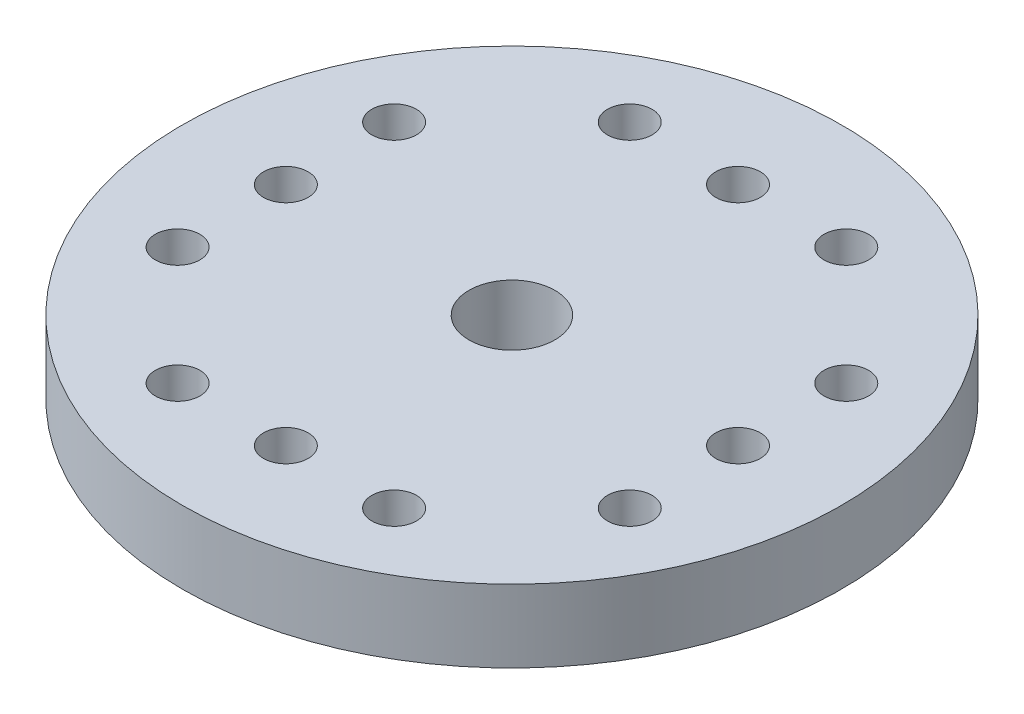
ISO-10303-21;
HEADER;
FILE_DESCRIPTION(('STEP AP214'),'2;1');
FILE_NAME('part.step','',(''),(''),'','','');
FILE_SCHEMA(('AUTOMOTIVE_DESIGN { 1 0 10303 214 1 1 1 1 }'));
ENDSEC;
DATA;
#1=APPLICATION_CONTEXT('core data for automotive mechanical design processes');
#2=APPLICATION_PROTOCOL_DEFINITION('international standard','automotive_design',2000,#1);
#3=PRODUCT_CONTEXT('',#1,'mechanical');
#4=PRODUCT('Part','Part','',(#3));
#5=PRODUCT_RELATED_PRODUCT_CATEGORY('part','',(#4));
#6=PRODUCT_DEFINITION_FORMATION('','',#4);
#7=PRODUCT_DEFINITION_CONTEXT('part definition',#1,'design');
#8=PRODUCT_DEFINITION('design','',#6,#7);
#9=PRODUCT_DEFINITION_SHAPE('','',#8);
#10=(LENGTH_UNIT() NAMED_UNIT(*) SI_UNIT(.MILLI.,.METRE.));
#11=(NAMED_UNIT(*) PLANE_ANGLE_UNIT() SI_UNIT($,.RADIAN.));
#12=(NAMED_UNIT(*) SI_UNIT($,.STERADIAN.) SOLID_ANGLE_UNIT());
#13=UNCERTAINTY_MEASURE_WITH_UNIT(LENGTH_MEASURE(1.E-05),#10,'distance_accuracy_value','');
#14=(GEOMETRIC_REPRESENTATION_CONTEXT(3) GLOBAL_UNCERTAINTY_ASSIGNED_CONTEXT((#13)) GLOBAL_UNIT_ASSIGNED_CONTEXT((#10,
#11,#12)) REPRESENTATION_CONTEXT('',''));
#15=CARTESIAN_POINT('',(0.,0.,0.));
#16=DIRECTION('',(0.,0.,1.));
#17=DIRECTION('',(1.,0.,0.));
#18=AXIS2_PLACEMENT_3D('',#15,#16,#17);
#19=CARTESIAN_POINT('',(0.,-2.28,0.));
#20=DIRECTION('',(0.,1.,0.));
#21=DIRECTION('',(0.,0.,1.));
#22=AXIS2_PLACEMENT_3D('',#19,#20,#21);
#23=CYLINDRICAL_SURFACE('',#22,10.35);
#24=CARTESIAN_POINT('',(0.,-2.28,0.));
#25=DIRECTION('',(0.,1.,0.));
#26=DIRECTION('',(0.,0.,1.));
#27=AXIS2_PLACEMENT_3D('',#24,#25,#26);
#28=CIRCLE('',#27,10.35);
#29=CARTESIAN_POINT('',(0.,-2.28,10.35));
#30=VERTEX_POINT('',#29);
#31=EDGE_CURVE('E38',#30,#30,#28,.T.);
#32=ORIENTED_EDGE('',*,*,#31,.T.);
#33=EDGE_LOOP('',(#32));
#34=FACE_BOUND('',#33,.T.);
#35=CARTESIAN_POINT('',(0.,0.,0.));
#36=DIRECTION('',(0.,1.,0.));
#37=DIRECTION('',(0.,0.,1.));
#38=AXIS2_PLACEMENT_3D('',#35,#36,#37);
#39=CIRCLE('',#38,10.35);
#40=CARTESIAN_POINT('',(0.,0.,10.35));
#41=VERTEX_POINT('',#40);
#42=EDGE_CURVE('E43',#41,#41,#39,.T.);
#43=ORIENTED_EDGE('',*,*,#42,.F.);
#44=EDGE_LOOP('',(#43));
#45=FACE_BOUND('',#44,.T.);
#46=ADVANCED_FACE('F31',(#34,#45),#23,.T.);
#47=CARTESIAN_POINT('',(0.,-2.28,0.));
#48=DIRECTION('',(0.,1.,0.));
#49=DIRECTION('',(0.,0.,1.));
#50=AXIS2_PLACEMENT_3D('',#47,#48,#49);
#51=PLANE('',#50);
#52=CARTESIAN_POINT('',(0.,-2.28,-7.1));
#53=DIRECTION('',(0.,1.,0.));
#54=DIRECTION('',(0.,0.,1.));
#55=AXIS2_PLACEMENT_3D('',#52,#53,#54);
#56=CIRCLE('',#55,0.7);
#57=CARTESIAN_POINT('',(0.,-2.28,-6.4));
#58=VERTEX_POINT('',#57);
#59=EDGE_CURVE('E80',#58,#58,#56,.T.);
#60=ORIENTED_EDGE('',*,*,#59,.T.);
#61=EDGE_LOOP('',(#60));
#62=FACE_BOUND('',#61,.T.);
#63=CARTESIAN_POINT('',(3.39999999999997,-2.28,-7.10000000000001));
#64=DIRECTION('',(0.,1.,0.));
#65=DIRECTION('',(0.,0.,1.));
#66=AXIS2_PLACEMENT_3D('',#63,#64,#65);
#67=CIRCLE('',#66,0.700000000000001);
#68=CARTESIAN_POINT('',(3.39999999999997,-2.28,-6.40000000000001));
#69=VERTEX_POINT('',#68);
#70=EDGE_CURVE('E87',#69,#69,#67,.T.);
#71=ORIENTED_EDGE('',*,*,#70,.T.);
#72=EDGE_LOOP('',(#71));
#73=FACE_BOUND('',#72,.T.);
#74=CARTESIAN_POINT('',(-7.1,-2.28,3.4));
#75=DIRECTION('',(0.,1.,0.));
#76=DIRECTION('',(0.,0.,1.));
#77=AXIS2_PLACEMENT_3D('',#74,#75,#76);
#78=CIRCLE('',#77,0.7);
#79=CARTESIAN_POINT('',(-7.1,-2.28,4.1));
#80=VERTEX_POINT('',#79);
#81=EDGE_CURVE('E90',#80,#80,#78,.T.);
#82=ORIENTED_EDGE('',*,*,#81,.T.);
#83=EDGE_LOOP('',(#82));
#84=FACE_BOUND('',#83,.T.);
#85=CARTESIAN_POINT('',(-7.1,-2.28,0.));
#86=DIRECTION('',(0.,1.,0.));
#87=DIRECTION('',(0.,0.,1.));
#88=AXIS2_PLACEMENT_3D('',#85,#86,#87);
#89=CIRCLE('',#88,0.7);
#90=CARTESIAN_POINT('',(-7.1,-2.28,0.7));
#91=VERTEX_POINT('',#90);
#92=EDGE_CURVE('E93',#91,#91,#89,.T.);
#93=ORIENTED_EDGE('',*,*,#92,.T.);
#94=EDGE_LOOP('',(#93));
#95=FACE_BOUND('',#94,.T.);
#96=CARTESIAN_POINT('',(-3.39999999999993,-2.28,7.10000000000004));
#97=DIRECTION('',(0.,1.,0.));
#98=DIRECTION('',(0.,0.,1.));
#99=AXIS2_PLACEMENT_3D('',#96,#97,#98);
#100=CIRCLE('',#99,0.700000000000001);
#101=CARTESIAN_POINT('',(-3.39999999999993,-2.28,7.80000000000004));
#102=VERTEX_POINT('',#101);
#103=EDGE_CURVE('E96',#102,#102,#100,.T.);
#104=ORIENTED_EDGE('',*,*,#103,.T.);
#105=EDGE_LOOP('',(#104));
#106=FACE_BOUND('',#105,.T.);
#107=CARTESIAN_POINT('',(0.,-2.28,7.1));
#108=DIRECTION('',(0.,1.,0.));
#109=DIRECTION('',(0.,0.,1.));
#110=AXIS2_PLACEMENT_3D('',#107,#108,#109);
#111=CIRCLE('',#110,0.7);
#112=CARTESIAN_POINT('',(0.,-2.28,7.8));
#113=VERTEX_POINT('',#112);
#114=EDGE_CURVE('E99',#113,#113,#111,.T.);
#115=ORIENTED_EDGE('',*,*,#114,.T.);
#116=EDGE_LOOP('',(#115));
#117=FACE_BOUND('',#116,.T.);
#118=CARTESIAN_POINT('',(3.40000000000007,-2.28,7.09999999999997));
#119=DIRECTION('',(0.,1.,0.));
#120=DIRECTION('',(0.,0.,1.));
#121=AXIS2_PLACEMENT_3D('',#118,#119,#120);
#122=CIRCLE('',#121,0.7);
#123=CARTESIAN_POINT('',(3.40000000000007,-2.28,7.79999999999997));
#124=VERTEX_POINT('',#123);
#125=EDGE_CURVE('E102',#124,#124,#122,.T.);
#126=ORIENTED_EDGE('',*,*,#125,.T.);
#127=EDGE_LOOP('',(#126));
#128=FACE_BOUND('',#127,.T.);
#129=CARTESIAN_POINT('',(-7.1,-2.28,-3.4));
#130=DIRECTION('',(0.,1.,0.));
#131=DIRECTION('',(0.,0.,1.));
#132=AXIS2_PLACEMENT_3D('',#129,#130,#131);
#133=CIRCLE('',#132,0.700000000000001);
#134=CARTESIAN_POINT('',(-7.1,-2.28,-2.7));
#135=VERTEX_POINT('',#134);
#136=EDGE_CURVE('E105',#135,#135,#133,.T.);
#137=ORIENTED_EDGE('',*,*,#136,.T.);
#138=EDGE_LOOP('',(#137));
#139=FACE_BOUND('',#138,.T.);
#140=CARTESIAN_POINT('',(-3.40000000000002,-2.28,-7.09999999999999));
#141=DIRECTION('',(0.,1.,0.));
#142=DIRECTION('',(0.,0.,1.));
#143=AXIS2_PLACEMENT_3D('',#140,#141,#142);
#144=CIRCLE('',#143,0.7);
#145=CARTESIAN_POINT('',(-3.40000000000002,-2.28,-6.39999999999999));
#146=VERTEX_POINT('',#145);
#147=EDGE_CURVE('E108',#146,#146,#144,.T.);
#148=ORIENTED_EDGE('',*,*,#147,.T.);
#149=EDGE_LOOP('',(#148));
#150=FACE_BOUND('',#149,.T.);
#151=CARTESIAN_POINT('',(7.1,-2.28,-3.4));
#152=DIRECTION('',(0.,1.,0.));
#153=DIRECTION('',(0.,0.,1.));
#154=AXIS2_PLACEMENT_3D('',#151,#152,#153);
#155=CIRCLE('',#154,0.7);
#156=CARTESIAN_POINT('',(7.1,-2.28,-2.7));
#157=VERTEX_POINT('',#156);
#158=EDGE_CURVE('E66',#157,#157,#155,.T.);
#159=ORIENTED_EDGE('',*,*,#158,.T.);
#160=EDGE_LOOP('',(#159));
#161=FACE_BOUND('',#160,.T.);
#162=CARTESIAN_POINT('',(7.1,-2.28,0.));
#163=DIRECTION('',(0.,1.,0.));
#164=DIRECTION('',(0.,0.,1.));
#165=AXIS2_PLACEMENT_3D('',#162,#163,#164);
#166=CIRCLE('',#165,0.7);
#167=CARTESIAN_POINT('',(7.1,-2.28,0.7));
#168=VERTEX_POINT('',#167);
#169=EDGE_CURVE('E69',#168,#168,#166,.T.);
#170=ORIENTED_EDGE('',*,*,#169,.T.);
#171=EDGE_LOOP('',(#170));
#172=FACE_BOUND('',#171,.T.);
#173=CARTESIAN_POINT('',(7.1,-2.28,3.4));
#174=DIRECTION('',(0.,1.,0.));
#175=DIRECTION('',(0.,0.,1.));
#176=AXIS2_PLACEMENT_3D('',#173,#174,#175);
#177=CIRCLE('',#176,0.700000000000001);
#178=CARTESIAN_POINT('',(7.1,-2.28,4.1));
#179=VERTEX_POINT('',#178);
#180=EDGE_CURVE('E72',#179,#179,#177,.T.);
#181=ORIENTED_EDGE('',*,*,#180,.T.);
#182=EDGE_LOOP('',(#181));
#183=FACE_BOUND('',#182,.T.);
#184=CARTESIAN_POINT('',(0.,-2.28,0.));
#185=DIRECTION('',(0.,-1.,0.));
#186=DIRECTION('',(0.,0.,-1.));
#187=AXIS2_PLACEMENT_3D('',#184,#185,#186);
#188=CIRCLE('',#187,4.35);
#189=CARTESIAN_POINT('',(0.,-2.28,-4.35));
#190=VERTEX_POINT('',#189);
#191=EDGE_CURVE('E10',#190,#190,#188,.T.);
#192=ORIENTED_EDGE('',*,*,#191,.F.);
#193=EDGE_LOOP('',(#192));
#194=FACE_BOUND('',#193,.T.);
#195=ORIENTED_EDGE('',*,*,#31,.F.);
#196=EDGE_LOOP('',(#195));
#197=FACE_BOUND('',#196,.T.);
#198=ADVANCED_FACE('F146',(#62,#73,#84,#95,#106,#117,#128,#139,#150,#161,#172,#183,#194,#197),
#51,.F.);
#199=CARTESIAN_POINT('',(0.,0.,0.));
#200=DIRECTION('',(0.,1.,0.));
#201=DIRECTION('',(0.,0.,1.));
#202=AXIS2_PLACEMENT_3D('',#199,#200,#201);
#203=PLANE('',#202);
#204=CARTESIAN_POINT('',(0.,0.,-7.1));
#205=DIRECTION('',(0.,1.,0.));
#206=DIRECTION('',(1.,0.,0.));
#207=AXIS2_PLACEMENT_3D('',#204,#205,#206);
#208=CIRCLE('',#207,0.7);
#209=CARTESIAN_POINT('',(0.699999999999975,0.,-7.1));
#210=VERTEX_POINT('',#209);
#211=EDGE_CURVE('E114',#210,#210,#208,.T.);
#212=ORIENTED_EDGE('',*,*,#211,.F.);
#213=EDGE_LOOP('',(#212));
#214=FACE_BOUND('',#213,.T.);
#215=CARTESIAN_POINT('',(3.39999999999997,0.,-7.10000000000001));
#216=DIRECTION('',(0.,1.,0.));
#217=DIRECTION('',(1.,0.,0.));
#218=AXIS2_PLACEMENT_3D('',#215,#216,#217);
#219=CIRCLE('',#218,0.700000000000001);
#220=CARTESIAN_POINT('',(4.09999999999997,0.,-7.10000000000002));
#221=VERTEX_POINT('',#220);
#222=EDGE_CURVE('E122',#221,#221,#219,.T.);
#223=ORIENTED_EDGE('',*,*,#222,.F.);
#224=EDGE_LOOP('',(#223));
#225=FACE_BOUND('',#224,.T.);
#226=CARTESIAN_POINT('',(-7.1,0.,3.4));
#227=DIRECTION('',(0.,1.,0.));
#228=DIRECTION('',(0.,0.,-1.));
#229=AXIS2_PLACEMENT_3D('',#226,#227,#228);
#230=CIRCLE('',#229,0.7);
#231=CARTESIAN_POINT('',(-7.1,0.,2.7));
#232=VERTEX_POINT('',#231);
#233=EDGE_CURVE('E118',#232,#232,#230,.T.);
#234=ORIENTED_EDGE('',*,*,#233,.F.);
#235=EDGE_LOOP('',(#234));
#236=FACE_BOUND('',#235,.T.);
#237=CARTESIAN_POINT('',(-7.1,0.,0.));
#238=DIRECTION('',(0.,1.,0.));
#239=DIRECTION('',(0.,0.,-1.));
#240=AXIS2_PLACEMENT_3D('',#237,#238,#239);
#241=CIRCLE('',#240,0.7);
#242=CARTESIAN_POINT('',(-7.1,0.,-0.7));
#243=VERTEX_POINT('',#242);
#244=EDGE_CURVE('E115',#243,#243,#241,.T.);
#245=ORIENTED_EDGE('',*,*,#244,.F.);
#246=EDGE_LOOP('',(#245));
#247=FACE_BOUND('',#246,.T.);
#248=CARTESIAN_POINT('',(-3.39999999999993,0.,7.10000000000004));
#249=DIRECTION('',(0.,1.,0.));
#250=DIRECTION('',(-1.,0.,0.));
#251=AXIS2_PLACEMENT_3D('',#248,#249,#250);
#252=CIRCLE('',#251,0.700000000000001);
#253=CARTESIAN_POINT('',(-4.09999999999993,0.,7.10000000000004));
#254=VERTEX_POINT('',#253);
#255=EDGE_CURVE('E133',#254,#254,#252,.T.);
#256=ORIENTED_EDGE('',*,*,#255,.F.);
#257=EDGE_LOOP('',(#256));
#258=FACE_BOUND('',#257,.T.);
#259=CARTESIAN_POINT('',(0.,0.,7.1));
#260=DIRECTION('',(0.,1.,0.));
#261=DIRECTION('',(-1.,0.,0.));
#262=AXIS2_PLACEMENT_3D('',#259,#260,#261);
#263=CIRCLE('',#262,0.7);
#264=CARTESIAN_POINT('',(-0.699999999999925,0.,7.10000000000001));
#265=VERTEX_POINT('',#264);
#266=EDGE_CURVE('E130',#265,#265,#263,.T.);
#267=ORIENTED_EDGE('',*,*,#266,.F.);
#268=EDGE_LOOP('',(#267));
#269=FACE_BOUND('',#268,.T.);
#270=CARTESIAN_POINT('',(3.40000000000007,0.,7.09999999999997));
#271=DIRECTION('',(0.,1.,0.));
#272=DIRECTION('',(-1.,0.,0.));
#273=AXIS2_PLACEMENT_3D('',#270,#271,#272);
#274=CIRCLE('',#273,0.7);
#275=CARTESIAN_POINT('',(2.70000000000007,0.,7.09999999999997));
#276=VERTEX_POINT('',#275);
#277=EDGE_CURVE('E127',#276,#276,#274,.T.);
#278=ORIENTED_EDGE('',*,*,#277,.F.);
#279=EDGE_LOOP('',(#278));
#280=FACE_BOUND('',#279,.T.);
#281=CARTESIAN_POINT('',(-7.1,0.,-3.4));
#282=DIRECTION('',(0.,1.,0.));
#283=DIRECTION('',(0.,0.,-1.));
#284=AXIS2_PLACEMENT_3D('',#281,#282,#283);
#285=CIRCLE('',#284,0.700000000000001);
#286=CARTESIAN_POINT('',(-7.1,0.,-4.1));
#287=VERTEX_POINT('',#286);
#288=EDGE_CURVE('E119',#287,#287,#285,.T.);
#289=ORIENTED_EDGE('',*,*,#288,.F.);
#290=EDGE_LOOP('',(#289));
#291=FACE_BOUND('',#290,.T.);
#292=CARTESIAN_POINT('',(-3.40000000000002,0.,-7.09999999999999));
#293=DIRECTION('',(0.,1.,0.));
#294=DIRECTION('',(1.,0.,0.));
#295=AXIS2_PLACEMENT_3D('',#292,#293,#294);
#296=CIRCLE('',#295,0.7);
#297=CARTESIAN_POINT('',(-2.70000000000002,0.,-7.09999999999999));
#298=VERTEX_POINT('',#297);
#299=EDGE_CURVE('E111',#298,#298,#296,.T.);
#300=ORIENTED_EDGE('',*,*,#299,.F.);
#301=EDGE_LOOP('',(#300));
#302=FACE_BOUND('',#301,.T.);
#303=CARTESIAN_POINT('',(7.1,0.,-3.4));
#304=DIRECTION('',(0.,1.,0.));
#305=DIRECTION('',(0.,0.,1.));
#306=AXIS2_PLACEMENT_3D('',#303,#304,#305);
#307=CIRCLE('',#306,0.7);
#308=CARTESIAN_POINT('',(7.1,0.,-2.7));
#309=VERTEX_POINT('',#308);
#310=EDGE_CURVE('E75',#309,#309,#307,.T.);
#311=ORIENTED_EDGE('',*,*,#310,.F.);
#312=EDGE_LOOP('',(#311));
#313=FACE_BOUND('',#312,.T.);
#314=CARTESIAN_POINT('',(7.1,0.,0.));
#315=DIRECTION('',(0.,1.,0.));
#316=DIRECTION('',(0.,0.,1.));
#317=AXIS2_PLACEMENT_3D('',#314,#315,#316);
#318=CIRCLE('',#317,0.7);
#319=CARTESIAN_POINT('',(7.1,0.,0.7));
#320=VERTEX_POINT('',#319);
#321=EDGE_CURVE('E79',#320,#320,#318,.T.);
#322=ORIENTED_EDGE('',*,*,#321,.F.);
#323=EDGE_LOOP('',(#322));
#324=FACE_BOUND('',#323,.T.);
#325=CARTESIAN_POINT('',(7.1,0.,3.4));
#326=DIRECTION('',(0.,1.,0.));
#327=DIRECTION('',(0.,0.,1.));
#328=AXIS2_PLACEMENT_3D('',#325,#326,#327);
#329=CIRCLE('',#328,0.700000000000001);
#330=CARTESIAN_POINT('',(7.1,0.,4.1));
#331=VERTEX_POINT('',#330);
#332=EDGE_CURVE('E76',#331,#331,#329,.T.);
#333=ORIENTED_EDGE('',*,*,#332,.F.);
#334=EDGE_LOOP('',(#333));
#335=FACE_BOUND('',#334,.T.);
#336=CARTESIAN_POINT('',(0.,0.,0.));
#337=DIRECTION('',(0.,1.,0.));
#338=DIRECTION('',(0.,0.,1.));
#339=AXIS2_PLACEMENT_3D('',#336,#337,#338);
#340=CIRCLE('',#339,1.35);
#341=CARTESIAN_POINT('',(0.,0.,1.35));
#342=VERTEX_POINT('',#341);
#343=EDGE_CURVE('E52',#342,#342,#340,.T.);
#344=ORIENTED_EDGE('',*,*,#343,.F.);
#345=EDGE_LOOP('',(#344));
#346=FACE_BOUND('',#345,.T.);
#347=ORIENTED_EDGE('',*,*,#42,.T.);
#348=EDGE_LOOP('',(#347));
#349=FACE_BOUND('',#348,.T.);
#350=ADVANCED_FACE('F142',(#214,#225,#236,#247,#258,#269,#280,#291,#302,#313,#324,#335,#346,
#349),#203,.T.);
#351=CARTESIAN_POINT('',(0.,-5.38,0.));
#352=DIRECTION('',(0.,1.,0.));
#353=DIRECTION('',(0.,0.,1.));
#354=AXIS2_PLACEMENT_3D('',#351,#352,#353);
#355=CYLINDRICAL_SURFACE('',#354,4.35);
#356=CARTESIAN_POINT('',(0.,-5.38,0.));
#357=DIRECTION('',(0.,-1.,0.));
#358=DIRECTION('',(0.,0.,-1.));
#359=AXIS2_PLACEMENT_3D('',#356,#357,#358);
#360=CIRCLE('',#359,4.35);
#361=CARTESIAN_POINT('',(0.,-5.38,-4.35));
#362=VERTEX_POINT('',#361);
#363=EDGE_CURVE('E46',#362,#362,#360,.T.);
#364=ORIENTED_EDGE('',*,*,#363,.F.);
#365=EDGE_LOOP('',(#364));
#366=FACE_BOUND('',#365,.T.);
#367=ORIENTED_EDGE('',*,*,#191,.T.);
#368=EDGE_LOOP('',(#367));
#369=FACE_BOUND('',#368,.T.);
#370=ADVANCED_FACE('F145',(#366,#369),#355,.T.);
#371=CARTESIAN_POINT('',(0.,-5.38,0.));
#372=DIRECTION('',(0.,-1.,0.));
#373=DIRECTION('',(0.,0.,-1.));
#374=AXIS2_PLACEMENT_3D('',#371,#372,#373);
#375=PLANE('',#374);
#376=CARTESIAN_POINT('',(0.,-5.38,0.));
#377=DIRECTION('',(0.,-1.,0.));
#378=DIRECTION('',(0.,0.,-1.));
#379=AXIS2_PLACEMENT_3D('',#376,#377,#378);
#380=CIRCLE('',#379,2.65);
#381=CARTESIAN_POINT('',(0.,-5.38,-2.65));
#382=VERTEX_POINT('',#381);
#383=EDGE_CURVE('E63',#382,#382,#380,.T.);
#384=ORIENTED_EDGE('',*,*,#383,.F.);
#385=EDGE_LOOP('',(#384));
#386=FACE_BOUND('',#385,.T.);
#387=ORIENTED_EDGE('',*,*,#363,.T.);
#388=EDGE_LOOP('',(#387));
#389=FACE_BOUND('',#388,.T.);
#390=ADVANCED_FACE('F196',(#386,#389),#375,.T.);
#391=CARTESIAN_POINT('',(0.,-5.38,0.));
#392=DIRECTION('',(0.,1.,0.));
#393=DIRECTION('',(0.,0.,1.));
#394=AXIS2_PLACEMENT_3D('',#391,#392,#393);
#395=CYLINDRICAL_SURFACE('',#394,1.35);
#396=CARTESIAN_POINT('',(0.,-2.28,0.));
#397=DIRECTION('',(0.,1.,0.));
#398=DIRECTION('',(0.,0.,1.));
#399=AXIS2_PLACEMENT_3D('',#396,#397,#398);
#400=CIRCLE('',#399,1.35);
#401=CARTESIAN_POINT('',(0.,-2.28,1.35));
#402=VERTEX_POINT('',#401);
#403=EDGE_CURVE('E34',#402,#402,#400,.F.);
#404=ORIENTED_EDGE('',*,*,#403,.T.);
#405=EDGE_LOOP('',(#404));
#406=FACE_BOUND('',#405,.T.);
#407=ORIENTED_EDGE('',*,*,#343,.T.);
#408=EDGE_LOOP('',(#407));
#409=FACE_BOUND('',#408,.T.);
#410=ADVANCED_FACE('F204',(#406,#409),#395,.F.);
#411=CARTESIAN_POINT('',(0.,-2.28,0.));
#412=DIRECTION('',(0.,1.,0.));
#413=DIRECTION('',(0.,0.,1.));
#414=AXIS2_PLACEMENT_3D('',#411,#412,#413);
#415=PLANE('',#414);
#416=CARTESIAN_POINT('',(0.,-2.28,0.));
#417=DIRECTION('',(0.,1.,0.));
#418=DIRECTION('',(0.,0.,1.));
#419=AXIS2_PLACEMENT_3D('',#416,#417,#418);
#420=CIRCLE('',#419,2.65);
#421=CARTESIAN_POINT('',(0.,-2.28,2.65));
#422=VERTEX_POINT('',#421);
#423=EDGE_CURVE('E59',#422,#422,#420,.F.);
#424=ORIENTED_EDGE('',*,*,#423,.T.);
#425=EDGE_LOOP('',(#424));
#426=FACE_BOUND('',#425,.T.);
#427=ORIENTED_EDGE('',*,*,#403,.F.);
#428=EDGE_LOOP('',(#427));
#429=FACE_BOUND('',#428,.T.);
#430=ADVANCED_FACE('F212',(#426,#429),#415,.F.);
#431=CARTESIAN_POINT('',(0.,5.2153318805774,0.));
#432=DIRECTION('',(0.,-1.,0.));
#433=DIRECTION('',(0.,0.,-1.));
#434=AXIS2_PLACEMENT_3D('',#431,#432,#433);
#435=CYLINDRICAL_SURFACE('',#434,2.65);
#436=ORIENTED_EDGE('',*,*,#383,.T.);
#437=EDGE_LOOP('',(#436));
#438=FACE_BOUND('',#437,.T.);
#439=ORIENTED_EDGE('',*,*,#423,.F.);
#440=EDGE_LOOP('',(#439));
#441=FACE_BOUND('',#440,.T.);
#442=ADVANCED_FACE('F165',(#438,#441),#435,.F.);
#443=CARTESIAN_POINT('',(7.1,-3.1,3.4));
#444=DIRECTION('',(0.,1.,0.));
#445=DIRECTION('',(0.,0.,1.));
#446=AXIS2_PLACEMENT_3D('',#443,#444,#445);
#447=CYLINDRICAL_SURFACE('',#446,0.700000000000001);
#448=ORIENTED_EDGE('',*,*,#332,.T.);
#449=EDGE_LOOP('',(#448));
#450=FACE_BOUND('',#449,.T.);
#451=ORIENTED_EDGE('',*,*,#180,.F.);
#452=EDGE_LOOP('',(#451));
#453=FACE_BOUND('',#452,.T.);
#454=ADVANCED_FACE('F161',(#450,#453),#447,.F.);
#455=CARTESIAN_POINT('',(7.1,-3.1,0.));
#456=DIRECTION('',(0.,1.,0.));
#457=DIRECTION('',(0.,0.,1.));
#458=AXIS2_PLACEMENT_3D('',#455,#456,#457);
#459=CYLINDRICAL_SURFACE('',#458,0.7);
#460=ORIENTED_EDGE('',*,*,#321,.T.);
#461=EDGE_LOOP('',(#460));
#462=FACE_BOUND('',#461,.T.);
#463=ORIENTED_EDGE('',*,*,#169,.F.);
#464=EDGE_LOOP('',(#463));
#465=FACE_BOUND('',#464,.T.);
#466=ADVANCED_FACE('F164',(#462,#465),#459,.F.);
#467=CARTESIAN_POINT('',(7.1,-3.1,-3.4));
#468=DIRECTION('',(0.,1.,0.));
#469=DIRECTION('',(0.,0.,1.));
#470=AXIS2_PLACEMENT_3D('',#467,#468,#469);
#471=CYLINDRICAL_SURFACE('',#470,0.7);
#472=ORIENTED_EDGE('',*,*,#310,.T.);
#473=EDGE_LOOP('',(#472));
#474=FACE_BOUND('',#473,.T.);
#475=ORIENTED_EDGE('',*,*,#158,.F.);
#476=EDGE_LOOP('',(#475));
#477=FACE_BOUND('',#476,.T.);
#478=ADVANCED_FACE('F238',(#474,#477),#471,.F.);
#479=CARTESIAN_POINT('',(-3.40000000000002,-3.1,-7.09999999999999));
#480=DIRECTION('',(0.,1.,0.));
#481=DIRECTION('',(0.,0.,1.));
#482=AXIS2_PLACEMENT_3D('',#479,#480,#481);
#483=CYLINDRICAL_SURFACE('',#482,0.7);
#484=ORIENTED_EDGE('',*,*,#299,.T.);
#485=EDGE_LOOP('',(#484));
#486=FACE_BOUND('',#485,.T.);
#487=ORIENTED_EDGE('',*,*,#147,.F.);
#488=EDGE_LOOP('',(#487));
#489=FACE_BOUND('',#488,.T.);
#490=ADVANCED_FACE('F245',(#486,#489),#483,.F.);
#491=CARTESIAN_POINT('',(-7.1,-3.1,-3.4));
#492=DIRECTION('',(0.,1.,0.));
#493=DIRECTION('',(0.,0.,1.));
#494=AXIS2_PLACEMENT_3D('',#491,#492,#493);
#495=CYLINDRICAL_SURFACE('',#494,0.700000000000001);
#496=ORIENTED_EDGE('',*,*,#288,.T.);
#497=EDGE_LOOP('',(#496));
#498=FACE_BOUND('',#497,.T.);
#499=ORIENTED_EDGE('',*,*,#136,.F.);
#500=EDGE_LOOP('',(#499));
#501=FACE_BOUND('',#500,.T.);
#502=ADVANCED_FACE('F252',(#498,#501),#495,.F.);
#503=CARTESIAN_POINT('',(3.40000000000007,-3.1,7.09999999999997));
#504=DIRECTION('',(0.,1.,0.));
#505=DIRECTION('',(0.,0.,1.));
#506=AXIS2_PLACEMENT_3D('',#503,#504,#505);
#507=CYLINDRICAL_SURFACE('',#506,0.7);
#508=ORIENTED_EDGE('',*,*,#277,.T.);
#509=EDGE_LOOP('',(#508));
#510=FACE_BOUND('',#509,.T.);
#511=ORIENTED_EDGE('',*,*,#125,.F.);
#512=EDGE_LOOP('',(#511));
#513=FACE_BOUND('',#512,.T.);
#514=ADVANCED_FACE('F260',(#510,#513),#507,.F.);
#515=CARTESIAN_POINT('',(0.,-3.1,7.1));
#516=DIRECTION('',(0.,1.,0.));
#517=DIRECTION('',(0.,0.,1.));
#518=AXIS2_PLACEMENT_3D('',#515,#516,#517);
#519=CYLINDRICAL_SURFACE('',#518,0.7);
#520=ORIENTED_EDGE('',*,*,#266,.T.);
#521=EDGE_LOOP('',(#520));
#522=FACE_BOUND('',#521,.T.);
#523=ORIENTED_EDGE('',*,*,#114,.F.);
#524=EDGE_LOOP('',(#523));
#525=FACE_BOUND('',#524,.T.);
#526=ADVANCED_FACE('F139',(#522,#525),#519,.F.);
#527=CARTESIAN_POINT('',(-3.39999999999993,-3.1,7.10000000000004));
#528=DIRECTION('',(0.,1.,0.));
#529=DIRECTION('',(0.,0.,1.));
#530=AXIS2_PLACEMENT_3D('',#527,#528,#529);
#531=CYLINDRICAL_SURFACE('',#530,0.700000000000001);
#532=ORIENTED_EDGE('',*,*,#255,.T.);
#533=EDGE_LOOP('',(#532));
#534=FACE_BOUND('',#533,.T.);
#535=ORIENTED_EDGE('',*,*,#103,.F.);
#536=EDGE_LOOP('',(#535));
#537=FACE_BOUND('',#536,.T.);
#538=ADVANCED_FACE('F275',(#534,#537),#531,.F.);
#539=CARTESIAN_POINT('',(-7.1,-3.1,0.));
#540=DIRECTION('',(0.,1.,0.));
#541=DIRECTION('',(0.,0.,1.));
#542=AXIS2_PLACEMENT_3D('',#539,#540,#541);
#543=CYLINDRICAL_SURFACE('',#542,0.7);
#544=ORIENTED_EDGE('',*,*,#244,.T.);
#545=EDGE_LOOP('',(#544));
#546=FACE_BOUND('',#545,.T.);
#547=ORIENTED_EDGE('',*,*,#92,.F.);
#548=EDGE_LOOP('',(#547));
#549=FACE_BOUND('',#548,.T.);
#550=ADVANCED_FACE('F282',(#546,#549),#543,.F.);
#551=CARTESIAN_POINT('',(-7.1,-3.1,3.4));
#552=DIRECTION('',(0.,1.,0.));
#553=DIRECTION('',(0.,0.,1.));
#554=AXIS2_PLACEMENT_3D('',#551,#552,#553);
#555=CYLINDRICAL_SURFACE('',#554,0.7);
#556=ORIENTED_EDGE('',*,*,#233,.T.);
#557=EDGE_LOOP('',(#556));
#558=FACE_BOUND('',#557,.T.);
#559=ORIENTED_EDGE('',*,*,#81,.F.);
#560=EDGE_LOOP('',(#559));
#561=FACE_BOUND('',#560,.T.);
#562=ADVANCED_FACE('F290',(#558,#561),#555,.F.);
#563=CARTESIAN_POINT('',(3.39999999999997,-3.1,-7.10000000000001));
#564=DIRECTION('',(0.,1.,0.));
#565=DIRECTION('',(0.,0.,1.));
#566=AXIS2_PLACEMENT_3D('',#563,#564,#565);
#567=CYLINDRICAL_SURFACE('',#566,0.700000000000001);
#568=ORIENTED_EDGE('',*,*,#222,.T.);
#569=EDGE_LOOP('',(#568));
#570=FACE_BOUND('',#569,.T.);
#571=ORIENTED_EDGE('',*,*,#70,.F.);
#572=EDGE_LOOP('',(#571));
#573=FACE_BOUND('',#572,.T.);
#574=ADVANCED_FACE('F298',(#570,#573),#567,.F.);
#575=CARTESIAN_POINT('',(0.,-3.1,-7.1));
#576=DIRECTION('',(0.,1.,0.));
#577=DIRECTION('',(0.,0.,1.));
#578=AXIS2_PLACEMENT_3D('',#575,#576,#577);
#579=CYLINDRICAL_SURFACE('',#578,0.7);
#580=ORIENTED_EDGE('',*,*,#211,.T.);
#581=EDGE_LOOP('',(#580));
#582=FACE_BOUND('',#581,.T.);
#583=ORIENTED_EDGE('',*,*,#59,.F.);
#584=EDGE_LOOP('',(#583));
#585=FACE_BOUND('',#584,.T.);
#586=ADVANCED_FACE('F306',(#582,#585),#579,.F.);
#587=CLOSED_SHELL('',(#46,#198,#350,#370,#390,#410,#430,#442,#454,#466,#478,#490,#502,#514,#526,
#538,#550,#562,#574,#586));
#588=MANIFOLD_SOLID_BREP('B2',#587);
#589=ADVANCED_BREP_SHAPE_REPRESENTATION('',(#18,#588),#14);
#590=SHAPE_DEFINITION_REPRESENTATION(#9,#589);
ENDSEC;
END-ISO-10303-21;
